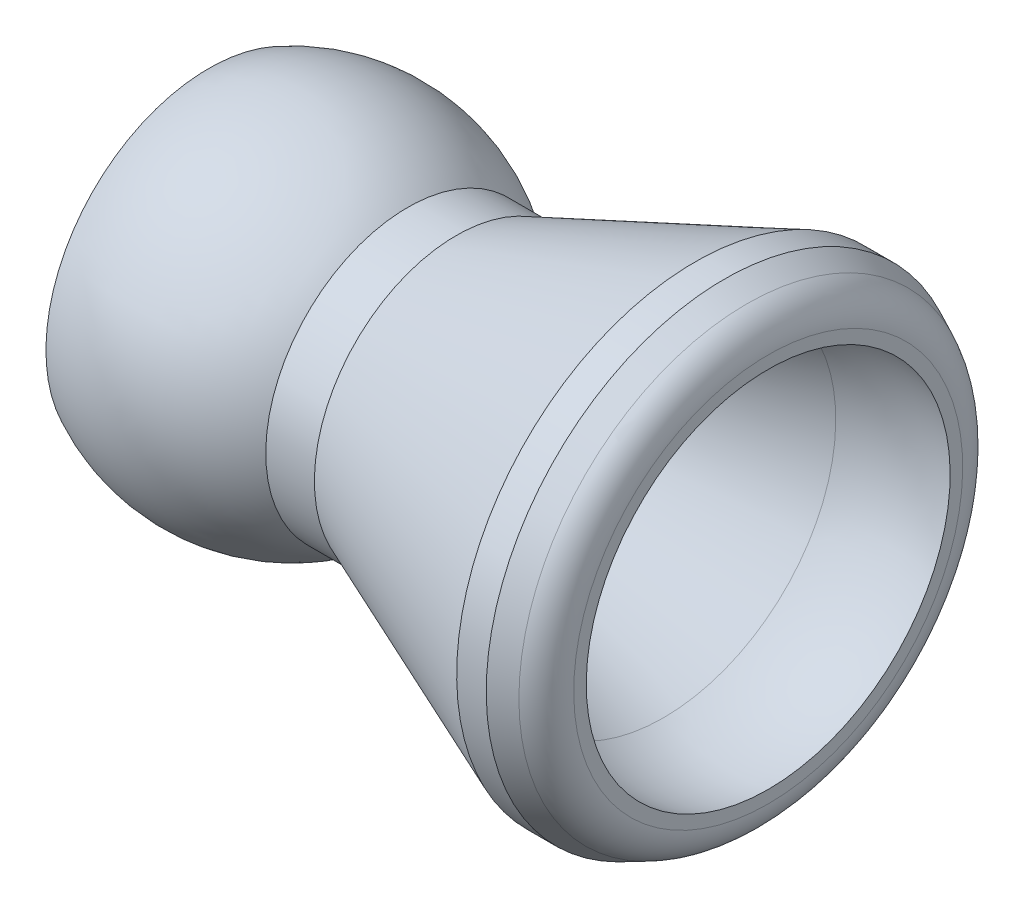
ISO-10303-21;
HEADER;
FILE_DESCRIPTION(('STEP AP214'),'2;1');
FILE_NAME('part.step','',(''),(''),'','','');
FILE_SCHEMA(('AUTOMOTIVE_DESIGN { 1 0 10303 214 1 1 1 1 }'));
ENDSEC;
DATA;
#1=APPLICATION_CONTEXT('core data for automotive mechanical design processes');
#2=APPLICATION_PROTOCOL_DEFINITION('international standard','automotive_design',2000,#1);
#3=PRODUCT_CONTEXT('',#1,'mechanical');
#4=PRODUCT('Part','Part','',(#3));
#5=PRODUCT_RELATED_PRODUCT_CATEGORY('part','',(#4));
#6=PRODUCT_DEFINITION_FORMATION('','',#4);
#7=PRODUCT_DEFINITION_CONTEXT('part definition',#1,'design');
#8=PRODUCT_DEFINITION('design','',#6,#7);
#9=PRODUCT_DEFINITION_SHAPE('','',#8);
#10=(LENGTH_UNIT() NAMED_UNIT(*) SI_UNIT(.MILLI.,.METRE.));
#11=(NAMED_UNIT(*) PLANE_ANGLE_UNIT() SI_UNIT($,.RADIAN.));
#12=(NAMED_UNIT(*) SI_UNIT($,.STERADIAN.) SOLID_ANGLE_UNIT());
#13=UNCERTAINTY_MEASURE_WITH_UNIT(LENGTH_MEASURE(1.E-05),#10,'distance_accuracy_value','');
#14=(GEOMETRIC_REPRESENTATION_CONTEXT(3) GLOBAL_UNCERTAINTY_ASSIGNED_CONTEXT((#13)) GLOBAL_UNIT_ASSIGNED_CONTEXT((#10,
#11,#12)) REPRESENTATION_CONTEXT('',''));
#15=CARTESIAN_POINT('',(0.,0.,0.));
#16=DIRECTION('',(0.,0.,1.));
#17=DIRECTION('',(1.,0.,0.));
#18=AXIS2_PLACEMENT_3D('',#15,#16,#17);
#19=CARTESIAN_POINT('',(-6.74342572708982,0.,0.));
#20=DIRECTION('',(-1.,0.,0.));
#21=DIRECTION('',(0.,-1.,0.));
#22=AXIS2_PLACEMENT_3D('',#19,#20,#21);
#23=DEGENERATE_TOROIDAL_SURFACE('',#22,0.000186321539720683,6.2865,.T.);
#24=CARTESIAN_POINT('',(-9.61390000000001,0.,0.));
#25=DIRECTION('',(-1.,0.,0.));
#26=DIRECTION('',(0.,-1.,0.));
#27=AXIS2_PLACEMENT_3D('',#24,#25,#26);
#28=CIRCLE('',#27,5.59307999999999);
#29=CARTESIAN_POINT('',(-9.61390000000001,-5.59307999999997,0.));
#30=VERTEX_POINT('',#29);
#31=EDGE_CURVE('E59',#30,#30,#28,.T.);
#32=ORIENTED_EDGE('',*,*,#31,.F.);
#33=EDGE_LOOP('',(#32));
#34=FACE_BOUND('',#33,.T.);
#35=CARTESIAN_POINT('',(-2.77622,0.,0.));
#36=DIRECTION('',(-1.,0.,0.));
#37=DIRECTION('',(0.,-1.,0.));
#38=AXIS2_PLACEMENT_3D('',#35,#36,#37);
#39=CIRCLE('',#38,4.87679999999998);
#40=CARTESIAN_POINT('',(-2.77622,-4.87679999999996,0.));
#41=VERTEX_POINT('',#40);
#42=EDGE_CURVE('E86',#41,#41,#39,.T.);
#43=ORIENTED_EDGE('',*,*,#42,.T.);
#44=EDGE_LOOP('',(#43));
#45=FACE_BOUND('',#44,.T.);
#46=ADVANCED_FACE('F39',(#34,#45),#23,.T.);
#47=CARTESIAN_POINT('',(-9.6139,5.59308,0.));
#48=DIRECTION('',(1.,0.,0.));
#49=DIRECTION('',(0.,1.,0.));
#50=AXIS2_PLACEMENT_3D('',#47,#48,#49);
#51=PLANE('',#50);
#52=CARTESIAN_POINT('',(-9.6139,0.,0.));
#53=DIRECTION('',(1.,0.,0.));
#54=DIRECTION('',(0.,1.,0.));
#55=AXIS2_PLACEMENT_3D('',#52,#53,#54);
#56=CIRCLE('',#55,4.68603720415648);
#57=CARTESIAN_POINT('',(-9.6139,4.6860372041565,0.));
#58=VERTEX_POINT('',#57);
#59=EDGE_CURVE('E10',#58,#58,#56,.T.);
#60=ORIENTED_EDGE('',*,*,#59,.T.);
#61=EDGE_LOOP('',(#60));
#62=FACE_BOUND('',#61,.T.);
#63=ORIENTED_EDGE('',*,*,#31,.T.);
#64=EDGE_LOOP('',(#63));
#65=FACE_BOUND('',#64,.T.);
#66=ADVANCED_FACE('F122',(#62,#65),#51,.F.);
#67=CARTESIAN_POINT('',(-152.4,0.,0.));
#68=DIRECTION('',(-1.,0.,0.));
#69=DIRECTION('',(0.,-1.,0.));
#70=AXIS2_PLACEMENT_3D('',#67,#68,#69);
#71=CYLINDRICAL_SURFACE('',#70,4.50849999999998);
#72=CARTESIAN_POINT('',(-9.17447999999996,0.,0.));
#73=DIRECTION('',(1.,0.,0.));
#74=DIRECTION('',(0.,1.,0.));
#75=AXIS2_PLACEMENT_3D('',#72,#73,#74);
#76=CIRCLE('',#75,4.50849999999998);
#77=CARTESIAN_POINT('',(-9.17447999999996,4.5085,0.));
#78=VERTEX_POINT('',#77);
#79=EDGE_CURVE('E46',#78,#78,#76,.F.);
#80=ORIENTED_EDGE('',*,*,#79,.T.);
#81=EDGE_LOOP('',(#80));
#82=FACE_BOUND('',#81,.T.);
#83=CARTESIAN_POINT('',(-5.48278475189309,0.,0.));
#84=DIRECTION('',(-1.,0.,0.));
#85=DIRECTION('',(0.,-1.,0.));
#86=AXIS2_PLACEMENT_3D('',#83,#84,#85);
#87=CIRCLE('',#86,4.50849999999998);
#88=CARTESIAN_POINT('',(-5.48278475189309,-4.50849999999997,0.));
#89=VERTEX_POINT('',#88);
#90=EDGE_CURVE('E62',#89,#89,#87,.T.);
#91=ORIENTED_EDGE('',*,*,#90,.F.);
#92=EDGE_LOOP('',(#91));
#93=FACE_BOUND('',#92,.T.);
#94=ADVANCED_FACE('F128',(#82,#93),#71,.F.);
#95=CARTESIAN_POINT('',(-5.48278475189309,0.,0.));
#96=DIRECTION('',(-1.,0.,0.));
#97=DIRECTION('',(0.,-1.,0.));
#98=AXIS2_PLACEMENT_3D('',#95,#96,#97);
#99=CONICAL_SURFACE('',#98,4.50849999999998,0.523598775598303);
#100=CARTESIAN_POINT('',(-3.17309500000001,0.,0.));
#101=DIRECTION('',(-1.,0.,0.));
#102=DIRECTION('',(0.,-1.,0.));
#103=AXIS2_PLACEMENT_3D('',#100,#101,#102);
#104=CIRCLE('',#103,3.17499999999998);
#105=CARTESIAN_POINT('',(-3.17309500000001,-3.17499999999996,0.));
#106=VERTEX_POINT('',#105);
#107=EDGE_CURVE('E65',#106,#106,#104,.T.);
#108=ORIENTED_EDGE('',*,*,#107,.F.);
#109=EDGE_LOOP('',(#108));
#110=FACE_BOUND('',#109,.T.);
#111=ORIENTED_EDGE('',*,*,#90,.T.);
#112=EDGE_LOOP('',(#111));
#113=FACE_BOUND('',#112,.T.);
#114=ADVANCED_FACE('F158',(#110,#113),#99,.F.);
#115=CARTESIAN_POINT('',(-152.4,0.,0.));
#116=DIRECTION('',(-1.,0.,0.));
#117=DIRECTION('',(0.,-1.,0.));
#118=AXIS2_PLACEMENT_3D('',#115,#116,#117);
#119=CYLINDRICAL_SURFACE('',#118,3.17499999999998);
#120=CARTESIAN_POINT('',(-0.774103589909425,0.,0.));
#121=DIRECTION('',(-1.,0.,0.));
#122=DIRECTION('',(0.,-1.,0.));
#123=AXIS2_PLACEMENT_3D('',#120,#121,#122);
#124=CIRCLE('',#123,3.17499999999998);
#125=CARTESIAN_POINT('',(-0.774103589909425,-3.17499999999996,0.));
#126=VERTEX_POINT('',#125);
#127=EDGE_CURVE('E68',#126,#126,#124,.T.);
#128=ORIENTED_EDGE('',*,*,#127,.F.);
#129=EDGE_LOOP('',(#128));
#130=FACE_BOUND('',#129,.T.);
#131=ORIENTED_EDGE('',*,*,#107,.T.);
#132=EDGE_LOOP('',(#131));
#133=FACE_BOUND('',#132,.T.);
#134=ADVANCED_FACE('F152',(#130,#133),#119,.F.);
#135=CARTESIAN_POINT('',(-0.774103589909425,0.,0.));
#136=DIRECTION('',(1.,0.,0.));
#137=DIRECTION('',(0.,1.,0.));
#138=AXIS2_PLACEMENT_3D('',#135,#136,#137);
#139=CONICAL_SURFACE('',#138,3.17499999999998,0.383972435438753);
#140=CARTESIAN_POINT('',(6.01671779368954,0.,0.));
#141=DIRECTION('',(-1.,0.,0.));
#142=DIRECTION('',(0.,-1.,0.));
#143=AXIS2_PLACEMENT_3D('',#140,#141,#142);
#144=CIRCLE('',#143,5.91866993393615);
#145=CARTESIAN_POINT('',(6.01671779368954,-5.91866993393613,0.));
#146=VERTEX_POINT('',#145);
#147=EDGE_CURVE('E71',#146,#146,#144,.T.);
#148=ORIENTED_EDGE('',*,*,#147,.F.);
#149=EDGE_LOOP('',(#148));
#150=FACE_BOUND('',#149,.T.);
#151=ORIENTED_EDGE('',*,*,#127,.T.);
#152=EDGE_LOOP('',(#151));
#153=FACE_BOUND('',#152,.T.);
#154=ADVANCED_FACE('F146',(#150,#153),#139,.F.);
#155=CARTESIAN_POINT('',(8.37168214319866,0.,0.));
#156=DIRECTION('',(-1.,0.,0.));
#157=DIRECTION('',(0.,-1.,0.));
#158=AXIS2_PLACEMENT_3D('',#155,#156,#157);
#159=DEGENERATE_TOROIDAL_SURFACE('',#158,0.0899286322020409,6.28650000000002,.T.);
#160=CARTESIAN_POINT('',(9.61389999999998,0.,0.));
#161=DIRECTION('',(-1.,0.,0.));
#162=DIRECTION('',(0.,-1.,0.));
#163=AXIS2_PLACEMENT_3D('',#160,#161,#162);
#164=CIRCLE('',#163,6.25247494409651);
#165=CARTESIAN_POINT('',(9.61389999999998,-6.25247494409649,0.));
#166=VERTEX_POINT('',#165);
#167=EDGE_CURVE('E74',#166,#166,#164,.T.);
#168=ORIENTED_EDGE('',*,*,#167,.F.);
#169=EDGE_LOOP('',(#168));
#170=FACE_BOUND('',#169,.T.);
#171=ORIENTED_EDGE('',*,*,#147,.T.);
#172=EDGE_LOOP('',(#171));
#173=FACE_BOUND('',#172,.T.);
#174=ADVANCED_FACE('F118',(#170,#173),#159,.F.);
#175=CARTESIAN_POINT('',(9.6139,7.49269134348892,0.));
#176=DIRECTION('',(-1.,0.,0.));
#177=DIRECTION('',(0.,-1.,0.));
#178=AXIS2_PLACEMENT_3D('',#175,#176,#177);
#179=PLANE('',#178);
#180=CARTESIAN_POINT('',(9.6139,0.,0.));
#181=DIRECTION('',(-1.,0.,0.));
#182=DIRECTION('',(0.,-1.,0.));
#183=AXIS2_PLACEMENT_3D('',#180,#181,#182);
#184=CIRCLE('',#183,6.68361211226338);
#185=CARTESIAN_POINT('',(9.6139,-6.68361211226336,0.));
#186=VERTEX_POINT('',#185);
#187=EDGE_CURVE('E50',#186,#186,#184,.F.);
#188=ORIENTED_EDGE('',*,*,#187,.T.);
#189=EDGE_LOOP('',(#188));
#190=FACE_BOUND('',#189,.T.);
#191=ORIENTED_EDGE('',*,*,#167,.T.);
#192=EDGE_LOOP('',(#191));
#193=FACE_BOUND('',#192,.T.);
#194=ADVANCED_FACE('F112',(#190,#193),#179,.F.);
#195=CARTESIAN_POINT('',(9.61390000000001,0.,0.));
#196=DIRECTION('',(-1.,0.,0.));
#197=DIRECTION('',(0.,-1.,0.));
#198=AXIS2_PLACEMENT_3D('',#195,#196,#197);
#199=CONICAL_SURFACE('',#198,7.4926913434889,0.43633231299858);
#200=CARTESIAN_POINT('',(8.88062519241068,0.,0.));
#201=DIRECTION('',(1.,0.,0.));
#202=DIRECTION('',(0.,1.,0.));
#203=AXIS2_PLACEMENT_3D('',#200,#201,#202);
#204=CIRCLE('',#203,7.83462300179993);
#205=CARTESIAN_POINT('',(8.88062519241068,7.83462300179995,0.));
#206=VERTEX_POINT('',#205);
#207=EDGE_CURVE('E54',#206,#206,#204,.F.);
#208=ORIENTED_EDGE('',*,*,#207,.T.);
#209=EDGE_LOOP('',(#208));
#210=FACE_BOUND('',#209,.T.);
#211=CARTESIAN_POINT('',(8.11529999999999,0.,0.));
#212=DIRECTION('',(-1.,0.,0.));
#213=DIRECTION('',(0.,-1.,0.));
#214=AXIS2_PLACEMENT_3D('',#211,#212,#213);
#215=CIRCLE('',#214,8.19149999999998);
#216=CARTESIAN_POINT('',(8.11529999999999,-8.19149999999996,0.));
#217=VERTEX_POINT('',#216);
#218=EDGE_CURVE('E77',#217,#217,#215,.T.);
#219=ORIENTED_EDGE('',*,*,#218,.F.);
#220=EDGE_LOOP('',(#219));
#221=FACE_BOUND('',#220,.T.);
#222=ADVANCED_FACE('F107',(#210,#221),#199,.T.);
#223=CARTESIAN_POINT('',(-152.4,0.,0.));
#224=DIRECTION('',(-1.,0.,0.));
#225=DIRECTION('',(0.,-1.,0.));
#226=AXIS2_PLACEMENT_3D('',#223,#224,#225);
#227=CYLINDRICAL_SURFACE('',#226,8.19149999999998);
#228=CARTESIAN_POINT('',(7.09927039301897,0.,0.));
#229=DIRECTION('',(-1.,0.,0.));
#230=DIRECTION('',(0.,-1.,0.));
#231=AXIS2_PLACEMENT_3D('',#228,#229,#230);
#232=CIRCLE('',#231,8.19149999999998);
#233=CARTESIAN_POINT('',(7.09927039301897,-8.19149999999996,0.));
#234=VERTEX_POINT('',#233);
#235=EDGE_CURVE('E80',#234,#234,#232,.T.);
#236=ORIENTED_EDGE('',*,*,#235,.F.);
#237=EDGE_LOOP('',(#236));
#238=FACE_BOUND('',#237,.T.);
#239=ORIENTED_EDGE('',*,*,#218,.T.);
#240=EDGE_LOOP('',(#239));
#241=FACE_BOUND('',#240,.T.);
#242=ADVANCED_FACE('F101',(#238,#241),#227,.T.);
#243=CARTESIAN_POINT('',(7.09927039301897,0.,0.));
#244=DIRECTION('',(1.,0.,0.));
#245=DIRECTION('',(0.,1.,0.));
#246=AXIS2_PLACEMENT_3D('',#243,#244,#245);
#247=CONICAL_SURFACE('',#246,8.19149999999998,0.383972435438754);
#248=CARTESIAN_POINT('',(-1.10489999999999,0.,0.));
#249=DIRECTION('',(-1.,0.,0.));
#250=DIRECTION('',(0.,-1.,0.));
#251=AXIS2_PLACEMENT_3D('',#248,#249,#250);
#252=CIRCLE('',#251,4.87679999999998);
#253=CARTESIAN_POINT('',(-1.10489999999999,-4.87679999999996,0.));
#254=VERTEX_POINT('',#253);
#255=EDGE_CURVE('E83',#254,#254,#252,.T.);
#256=ORIENTED_EDGE('',*,*,#255,.F.);
#257=EDGE_LOOP('',(#256));
#258=FACE_BOUND('',#257,.T.);
#259=ORIENTED_EDGE('',*,*,#235,.T.);
#260=EDGE_LOOP('',(#259));
#261=FACE_BOUND('',#260,.T.);
#262=ADVANCED_FACE('F95',(#258,#261),#247,.T.);
#263=CARTESIAN_POINT('',(-152.4,0.,0.));
#264=DIRECTION('',(-1.,0.,0.));
#265=DIRECTION('',(0.,-1.,0.));
#266=AXIS2_PLACEMENT_3D('',#263,#264,#265);
#267=CYLINDRICAL_SURFACE('',#266,4.87679999999998);
#268=ORIENTED_EDGE('',*,*,#42,.F.);
#269=EDGE_LOOP('',(#268));
#270=FACE_BOUND('',#269,.T.);
#271=ORIENTED_EDGE('',*,*,#255,.T.);
#272=EDGE_LOOP('',(#271));
#273=FACE_BOUND('',#272,.T.);
#274=ADVANCED_FACE('F91',(#270,#273),#267,.T.);
#275=CARTESIAN_POINT('',(8.3439,0.,0.));
#276=DIRECTION('',(-1.,0.,0.));
#277=DIRECTION('',(0.,-1.,0.));
#278=AXIS2_PLACEMENT_3D('',#275,#276,#277);
#279=TOROIDAL_SURFACE('',#278,6.68361211226338,1.27);
#280=ORIENTED_EDGE('',*,*,#187,.F.);
#281=EDGE_LOOP('',(#280));
#282=FACE_BOUND('',#281,.T.);
#283=ORIENTED_EDGE('',*,*,#207,.F.);
#284=EDGE_LOOP('',(#283));
#285=FACE_BOUND('',#284,.T.);
#286=ADVANCED_FACE('F94',(#282,#285),#279,.T.);
#287=CARTESIAN_POINT('',(-9.17447999999996,0.,0.));
#288=DIRECTION('',(-1.,0.,0.));
#289=DIRECTION('',(0.,-1.,0.));
#290=AXIS2_PLACEMENT_3D('',#287,#288,#289);
#291=CONICAL_SURFACE('',#290,4.50849999999998,0.383972435438737);
#292=ORIENTED_EDGE('',*,*,#59,.F.);
#293=EDGE_LOOP('',(#292));
#294=FACE_BOUND('',#293,.T.);
#295=ORIENTED_EDGE('',*,*,#79,.F.);
#296=EDGE_LOOP('',(#295));
#297=FACE_BOUND('',#296,.T.);
#298=ADVANCED_FACE('F41',(#294,#297),#291,.F.);
#299=CLOSED_SHELL('',(#46,#66,#94,#114,#134,#154,#174,#194,#222,#242,#262,#274,#286,#298));
#300=MANIFOLD_SOLID_BREP('B2',#299);
#301=ADVANCED_BREP_SHAPE_REPRESENTATION('',(#18,#300),#14);
#302=SHAPE_DEFINITION_REPRESENTATION(#9,#301);
ENDSEC;
END-ISO-10303-21;
